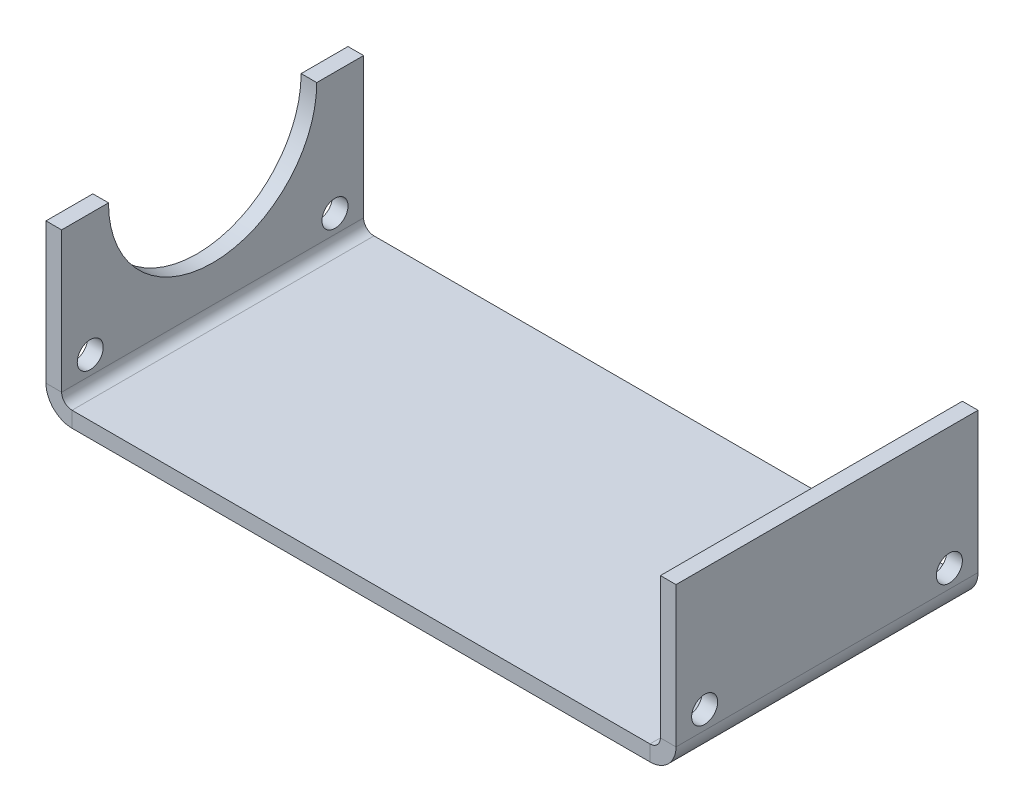
ISO-10303-21;
HEADER;
FILE_DESCRIPTION(('STEP AP214'),'2;1');
FILE_NAME('part.step','',(''),(''),'','','');
FILE_SCHEMA(('AUTOMOTIVE_DESIGN { 1 0 10303 214 1 1 1 1 }'));
ENDSEC;
DATA;
#1=APPLICATION_CONTEXT('core data for automotive mechanical design processes');
#2=APPLICATION_PROTOCOL_DEFINITION('international standard','automotive_design',2000,#1);
#3=PRODUCT_CONTEXT('',#1,'mechanical');
#4=PRODUCT('Part','Part','',(#3));
#5=PRODUCT_RELATED_PRODUCT_CATEGORY('part','',(#4));
#6=PRODUCT_DEFINITION_FORMATION('','',#4);
#7=PRODUCT_DEFINITION_CONTEXT('part definition',#1,'design');
#8=PRODUCT_DEFINITION('design','',#6,#7);
#9=PRODUCT_DEFINITION_SHAPE('','',#8);
#10=(LENGTH_UNIT() NAMED_UNIT(*) SI_UNIT(.MILLI.,.METRE.));
#11=(NAMED_UNIT(*) PLANE_ANGLE_UNIT() SI_UNIT($,.RADIAN.));
#12=(NAMED_UNIT(*) SI_UNIT($,.STERADIAN.) SOLID_ANGLE_UNIT());
#13=UNCERTAINTY_MEASURE_WITH_UNIT(LENGTH_MEASURE(1.E-05),#10,'distance_accuracy_value','');
#14=(GEOMETRIC_REPRESENTATION_CONTEXT(3) GLOBAL_UNCERTAINTY_ASSIGNED_CONTEXT((#13)) GLOBAL_UNIT_ASSIGNED_CONTEXT((#10,
#11,#12)) REPRESENTATION_CONTEXT('',''));
#15=CARTESIAN_POINT('',(0.,0.,0.));
#16=DIRECTION('',(0.,0.,1.));
#17=DIRECTION('',(1.,0.,0.));
#18=AXIS2_PLACEMENT_3D('',#15,#16,#17);
#19=CARTESIAN_POINT('',(0.,3.,0.));
#20=DIRECTION('',(0.,0.,-1.));
#21=DIRECTION('',(-1.,0.,0.));
#22=AXIS2_PLACEMENT_3D('',#19,#20,#21);
#23=PLANE('',#22);
#24=DIRECTION('',(0.,1.,0.));
#25=VECTOR('',#24,1.);
#26=CARTESIAN_POINT('',(116.,3.,0.));
#27=LINE('',#26,#25);
#28=CARTESIAN_POINT('',(116.,0.,0.));
#29=VERTEX_POINT('',#28);
#30=CARTESIAN_POINT('',(116.,3.,0.));
#31=VERTEX_POINT('',#30);
#32=EDGE_CURVE('E294',#29,#31,#27,.T.);
#33=ORIENTED_EDGE('',*,*,#32,.F.);
#34=DIRECTION('',(1.,0.,0.));
#35=VECTOR('',#34,1.);
#36=CARTESIAN_POINT('',(0.,0.,0.));
#37=LINE('',#36,#35);
#38=CARTESIAN_POINT('',(5.,0.,0.));
#39=VERTEX_POINT('',#38);
#40=EDGE_CURVE('E59',#29,#39,#37,.F.);
#41=ORIENTED_EDGE('',*,*,#40,.T.);
#42=DIRECTION('',(0.,1.,0.));
#43=VECTOR('',#42,1.);
#44=CARTESIAN_POINT('',(5.,3.,0.));
#45=LINE('',#44,#43);
#46=CARTESIAN_POINT('',(5.,3.,0.));
#47=VERTEX_POINT('',#46);
#48=EDGE_CURVE('E300',#39,#47,#45,.T.);
#49=ORIENTED_EDGE('',*,*,#48,.T.);
#50=DIRECTION('',(-1.,0.,0.));
#51=VECTOR('',#50,1.);
#52=CARTESIAN_POINT('',(0.,3.,0.));
#53=LINE('',#52,#51);
#54=EDGE_CURVE('E282',#31,#47,#53,.T.);
#55=ORIENTED_EDGE('',*,*,#54,.F.);
#56=EDGE_LOOP('',(#33,#41,#49,#55));
#57=FACE_BOUND('',#56,.T.);
#58=ADVANCED_FACE('F37',(#57),#23,.T.);
#59=CARTESIAN_POINT('',(0.,3.,58.));
#60=DIRECTION('',(0.,0.,1.));
#61=DIRECTION('',(1.,0.,0.));
#62=AXIS2_PLACEMENT_3D('',#59,#60,#61);
#63=PLANE('',#62);
#64=DIRECTION('',(0.,1.,0.));
#65=VECTOR('',#64,1.);
#66=CARTESIAN_POINT('',(5.,3.,58.));
#67=LINE('',#66,#65);
#68=CARTESIAN_POINT('',(5.,0.,58.));
#69=VERTEX_POINT('',#68);
#70=CARTESIAN_POINT('',(5.,3.,58.));
#71=VERTEX_POINT('',#70);
#72=EDGE_CURVE('E11',#69,#71,#67,.T.);
#73=ORIENTED_EDGE('',*,*,#72,.F.);
#74=DIRECTION('',(1.,0.,0.));
#75=VECTOR('',#74,1.);
#76=CARTESIAN_POINT('',(0.,0.,58.));
#77=LINE('',#76,#75);
#78=CARTESIAN_POINT('',(116.,0.,58.));
#79=VERTEX_POINT('',#78);
#80=EDGE_CURVE('E51',#69,#79,#77,.T.);
#81=ORIENTED_EDGE('',*,*,#80,.T.);
#82=DIRECTION('',(0.,1.,0.));
#83=VECTOR('',#82,1.);
#84=CARTESIAN_POINT('',(116.,3.,58.));
#85=LINE('',#84,#83);
#86=CARTESIAN_POINT('',(116.,3.,58.));
#87=VERTEX_POINT('',#86);
#88=EDGE_CURVE('E288',#79,#87,#85,.T.);
#89=ORIENTED_EDGE('',*,*,#88,.T.);
#90=DIRECTION('',(1.,0.,0.));
#91=VECTOR('',#90,1.);
#92=CARTESIAN_POINT('',(0.,3.,58.));
#93=LINE('',#92,#91);
#94=EDGE_CURVE('E280',#71,#87,#93,.T.);
#95=ORIENTED_EDGE('',*,*,#94,.F.);
#96=EDGE_LOOP('',(#73,#81,#89,#95));
#97=FACE_BOUND('',#96,.T.);
#98=ADVANCED_FACE('F362',(#97),#63,.T.);
#99=CARTESIAN_POINT('',(0.,3.,0.));
#100=DIRECTION('',(0.,1.,0.));
#101=DIRECTION('',(0.,0.,1.));
#102=AXIS2_PLACEMENT_3D('',#99,#100,#101);
#103=PLANE('',#102);
#104=ORIENTED_EDGE('',*,*,#54,.T.);
#105=DIRECTION('',(0.,0.,1.));
#106=VECTOR('',#105,1.);
#107=CARTESIAN_POINT('',(5.,3.,0.));
#108=LINE('',#107,#106);
#109=EDGE_CURVE('E297',#47,#71,#108,.T.);
#110=ORIENTED_EDGE('',*,*,#109,.T.);
#111=ORIENTED_EDGE('',*,*,#94,.T.);
#112=DIRECTION('',(0.,0.,-1.));
#113=VECTOR('',#112,1.);
#114=CARTESIAN_POINT('',(116.,3.,0.));
#115=LINE('',#114,#113);
#116=EDGE_CURVE('E285',#87,#31,#115,.T.);
#117=ORIENTED_EDGE('',*,*,#116,.T.);
#118=EDGE_LOOP('',(#104,#110,#111,#117));
#119=FACE_BOUND('',#118,.T.);
#120=ADVANCED_FACE('F314',(#119),#103,.T.);
#121=CARTESIAN_POINT('',(0.,0.,0.));
#122=DIRECTION('',(0.,1.,0.));
#123=DIRECTION('',(0.,0.,1.));
#124=AXIS2_PLACEMENT_3D('',#121,#122,#123);
#125=PLANE('',#124);
#126=ORIENTED_EDGE('',*,*,#40,.F.);
#127=DIRECTION('',(0.,0.,-1.));
#128=VECTOR('',#127,1.);
#129=CARTESIAN_POINT('',(116.,0.,0.));
#130=LINE('',#129,#128);
#131=EDGE_CURVE('E291',#79,#29,#130,.T.);
#132=ORIENTED_EDGE('',*,*,#131,.F.);
#133=ORIENTED_EDGE('',*,*,#80,.F.);
#134=DIRECTION('',(0.,0.,1.));
#135=VECTOR('',#134,1.);
#136=CARTESIAN_POINT('',(5.,0.,0.));
#137=LINE('',#136,#135);
#138=EDGE_CURVE('E44',#39,#69,#137,.T.);
#139=ORIENTED_EDGE('',*,*,#138,.F.);
#140=EDGE_LOOP('',(#126,#132,#133,#139));
#141=FACE_BOUND('',#140,.T.);
#142=ADVANCED_FACE('F307',(#141),#125,.F.);
#143=CARTESIAN_POINT('',(116.,5.,58.));
#144=DIRECTION('',(0.,0.,-1.));
#145=DIRECTION('',(-1.,0.,0.));
#146=AXIS2_PLACEMENT_3D('',#143,#144,#145);
#147=PLANE('',#146);
#148=ORIENTED_EDGE('',*,*,#88,.F.);
#149=CARTESIAN_POINT('',(116.,5.,58.));
#150=DIRECTION('',(0.,0.,-1.));
#151=DIRECTION('',(-1.,0.,0.));
#152=AXIS2_PLACEMENT_3D('',#149,#150,#151);
#153=CIRCLE('',#152,5.);
#154=CARTESIAN_POINT('',(121.,5.00000000000002,58.));
#155=VERTEX_POINT('',#154);
#156=EDGE_CURVE('E224',#79,#155,#153,.F.);
#157=ORIENTED_EDGE('',*,*,#156,.T.);
#158=DIRECTION('',(-1.,0.,0.));
#159=VECTOR('',#158,1.);
#160=CARTESIAN_POINT('',(118.,5.,58.));
#161=LINE('',#160,#159);
#162=CARTESIAN_POINT('',(118.,5.00000000000003,58.));
#163=VERTEX_POINT('',#162);
#164=EDGE_CURVE('E259',#155,#163,#161,.T.);
#165=ORIENTED_EDGE('',*,*,#164,.T.);
#166=CARTESIAN_POINT('',(116.,5.,58.));
#167=DIRECTION('',(0.,0.,1.));
#168=DIRECTION('',(1.,0.,0.));
#169=AXIS2_PLACEMENT_3D('',#166,#167,#168);
#170=CIRCLE('',#169,2.);
#171=EDGE_CURVE('E264',#87,#163,#170,.T.);
#172=ORIENTED_EDGE('',*,*,#171,.F.);
#173=EDGE_LOOP('',(#148,#157,#165,#172));
#174=FACE_BOUND('',#173,.T.);
#175=ADVANCED_FACE('F335',(#174),#147,.F.);
#176=CARTESIAN_POINT('',(116.,5.,0.));
#177=DIRECTION('',(0.,0.,1.));
#178=DIRECTION('',(1.,0.,0.));
#179=AXIS2_PLACEMENT_3D('',#176,#177,#178);
#180=PLANE('',#179);
#181=DIRECTION('',(-1.,0.,0.));
#182=VECTOR('',#181,1.);
#183=CARTESIAN_POINT('',(118.,5.,0.));
#184=LINE('',#183,#182);
#185=CARTESIAN_POINT('',(121.,5.,0.));
#186=VERTEX_POINT('',#185);
#187=CARTESIAN_POINT('',(118.,5.,0.));
#188=VERTEX_POINT('',#187);
#189=EDGE_CURVE('E222',#186,#188,#184,.T.);
#190=ORIENTED_EDGE('',*,*,#189,.F.);
#191=CARTESIAN_POINT('',(116.,5.,0.));
#192=DIRECTION('',(0.,0.,-1.));
#193=DIRECTION('',(-1.,0.,0.));
#194=AXIS2_PLACEMENT_3D('',#191,#192,#193);
#195=CIRCLE('',#194,5.);
#196=EDGE_CURVE('E268',#186,#29,#195,.T.);
#197=ORIENTED_EDGE('',*,*,#196,.T.);
#198=ORIENTED_EDGE('',*,*,#32,.T.);
#199=CARTESIAN_POINT('',(116.,5.,0.));
#200=DIRECTION('',(0.,0.,-1.));
#201=DIRECTION('',(-1.,0.,0.));
#202=AXIS2_PLACEMENT_3D('',#199,#200,#201);
#203=CIRCLE('',#202,2.);
#204=EDGE_CURVE('E267',#188,#31,#203,.T.);
#205=ORIENTED_EDGE('',*,*,#204,.F.);
#206=EDGE_LOOP('',(#190,#197,#198,#205));
#207=FACE_BOUND('',#206,.T.);
#208=ADVANCED_FACE('F319',(#207),#180,.F.);
#209=CARTESIAN_POINT('',(116.,5.,87.3371722273058));
#210=DIRECTION('',(0.,0.,-1.));
#211=DIRECTION('',(-1.,0.,0.));
#212=AXIS2_PLACEMENT_3D('',#209,#210,#211);
#213=CYLINDRICAL_SURFACE('',#212,2.);
#214=ORIENTED_EDGE('',*,*,#204,.T.);
#215=ORIENTED_EDGE('',*,*,#116,.F.);
#216=ORIENTED_EDGE('',*,*,#171,.T.);
#217=DIRECTION('',(0.,0.,1.));
#218=VECTOR('',#217,1.);
#219=CARTESIAN_POINT('',(118.,4.99999999999999,0.));
#220=LINE('',#219,#218);
#221=EDGE_CURVE('E237',#188,#163,#220,.T.);
#222=ORIENTED_EDGE('',*,*,#221,.F.);
#223=EDGE_LOOP('',(#214,#215,#216,#222));
#224=FACE_BOUND('',#223,.T.);
#225=ADVANCED_FACE('F322',(#224),#213,.F.);
#226=CARTESIAN_POINT('',(116.,5.,87.3371722273058));
#227=DIRECTION('',(0.,0.,-1.));
#228=DIRECTION('',(-1.,0.,0.));
#229=AXIS2_PLACEMENT_3D('',#226,#227,#228);
#230=CYLINDRICAL_SURFACE('',#229,5.);
#231=ORIENTED_EDGE('',*,*,#196,.F.);
#232=DIRECTION('',(0.,0.,1.));
#233=VECTOR('',#232,1.);
#234=CARTESIAN_POINT('',(121.,5.,0.));
#235=LINE('',#234,#233);
#236=EDGE_CURVE('E216',#186,#155,#235,.T.);
#237=ORIENTED_EDGE('',*,*,#236,.T.);
#238=ORIENTED_EDGE('',*,*,#156,.F.);
#239=ORIENTED_EDGE('',*,*,#131,.T.);
#240=EDGE_LOOP('',(#231,#237,#238,#239));
#241=FACE_BOUND('',#240,.T.);
#242=ADVANCED_FACE('F338',(#241),#230,.T.);
#243=CARTESIAN_POINT('',(118.,32.,0.));
#244=DIRECTION('',(0.,1.,0.));
#245=DIRECTION('',(0.,0.,1.));
#246=AXIS2_PLACEMENT_3D('',#243,#244,#245);
#247=PLANE('',#246);
#248=DIRECTION('',(-1.,0.,0.));
#249=VECTOR('',#248,1.);
#250=CARTESIAN_POINT('',(118.,32.,58.));
#251=LINE('',#250,#249);
#252=CARTESIAN_POINT('',(121.,32.,58.));
#253=VERTEX_POINT('',#252);
#254=CARTESIAN_POINT('',(118.,32.,58.));
#255=VERTEX_POINT('',#254);
#256=EDGE_CURVE('E235',#253,#255,#251,.T.);
#257=ORIENTED_EDGE('',*,*,#256,.F.);
#258=DIRECTION('',(0.,0.,-1.));
#259=VECTOR('',#258,1.);
#260=CARTESIAN_POINT('',(121.,32.,0.));
#261=LINE('',#260,#259);
#262=CARTESIAN_POINT('',(121.,32.,0.));
#263=VERTEX_POINT('',#262);
#264=EDGE_CURVE('E229',#263,#253,#261,.F.);
#265=ORIENTED_EDGE('',*,*,#264,.F.);
#266=DIRECTION('',(-1.,0.,0.));
#267=VECTOR('',#266,1.);
#268=CARTESIAN_POINT('',(118.,32.,0.));
#269=LINE('',#268,#267);
#270=CARTESIAN_POINT('',(118.,32.,0.));
#271=VERTEX_POINT('',#270);
#272=EDGE_CURVE('E257',#263,#271,#269,.T.);
#273=ORIENTED_EDGE('',*,*,#272,.T.);
#274=DIRECTION('',(0.,0.,1.));
#275=VECTOR('',#274,1.);
#276=CARTESIAN_POINT('',(118.,32.,0.));
#277=LINE('',#276,#275);
#278=EDGE_CURVE('E254',#271,#255,#277,.T.);
#279=ORIENTED_EDGE('',*,*,#278,.T.);
#280=EDGE_LOOP('',(#257,#265,#273,#279));
#281=FACE_BOUND('',#280,.T.);
#282=ADVANCED_FACE('F347',(#281),#247,.T.);
#283=CARTESIAN_POINT('',(118.,8.49999999999999,52.5));
#284=DIRECTION('',(1.,0.,0.));
#285=DIRECTION('',(0.,0.,-1.));
#286=AXIS2_PLACEMENT_3D('',#283,#284,#285);
#287=CYLINDRICAL_SURFACE('',#286,2.5);
#288=CARTESIAN_POINT('',(118.,8.49999999999999,52.5));
#289=DIRECTION('',(1.,0.,0.));
#290=DIRECTION('',(0.,0.,-1.));
#291=AXIS2_PLACEMENT_3D('',#288,#289,#290);
#292=CIRCLE('',#291,2.5);
#293=CARTESIAN_POINT('',(118.,8.49999999999999,50.));
#294=VERTEX_POINT('',#293);
#295=EDGE_CURVE('E242',#294,#294,#292,.T.);
#296=ORIENTED_EDGE('',*,*,#295,.F.);
#297=EDGE_LOOP('',(#296));
#298=FACE_BOUND('',#297,.T.);
#299=CARTESIAN_POINT('',(121.,8.49999999999999,52.5));
#300=DIRECTION('',(1.,0.,0.));
#301=DIRECTION('',(0.,0.,-1.));
#302=AXIS2_PLACEMENT_3D('',#299,#300,#301);
#303=CIRCLE('',#302,2.5);
#304=CARTESIAN_POINT('',(121.,8.49999999999999,50.));
#305=VERTEX_POINT('',#304);
#306=EDGE_CURVE('E251',#305,#305,#303,.T.);
#307=ORIENTED_EDGE('',*,*,#306,.T.);
#308=EDGE_LOOP('',(#307));
#309=FACE_BOUND('',#308,.T.);
#310=ADVANCED_FACE('F349',(#298,#309),#287,.F.);
#311=CARTESIAN_POINT('',(118.,8.50000000000001,5.50000000000002));
#312=DIRECTION('',(1.,0.,0.));
#313=DIRECTION('',(0.,0.,-1.));
#314=AXIS2_PLACEMENT_3D('',#311,#312,#313);
#315=CYLINDRICAL_SURFACE('',#314,2.5);
#316=CARTESIAN_POINT('',(118.,8.50000000000001,5.50000000000002));
#317=DIRECTION('',(1.,0.,0.));
#318=DIRECTION('',(0.,0.,-1.));
#319=AXIS2_PLACEMENT_3D('',#316,#317,#318);
#320=CIRCLE('',#319,2.5);
#321=CARTESIAN_POINT('',(118.,8.50000000000001,3.00000000000002));
#322=VERTEX_POINT('',#321);
#323=EDGE_CURVE('E245',#322,#322,#320,.T.);
#324=ORIENTED_EDGE('',*,*,#323,.F.);
#325=EDGE_LOOP('',(#324));
#326=FACE_BOUND('',#325,.T.);
#327=CARTESIAN_POINT('',(121.,8.50000000000001,5.50000000000002));
#328=DIRECTION('',(1.,0.,0.));
#329=DIRECTION('',(0.,0.,-1.));
#330=AXIS2_PLACEMENT_3D('',#327,#328,#329);
#331=CIRCLE('',#330,2.5);
#332=CARTESIAN_POINT('',(121.,8.50000000000001,3.00000000000002));
#333=VERTEX_POINT('',#332);
#334=EDGE_CURVE('E248',#333,#333,#331,.T.);
#335=ORIENTED_EDGE('',*,*,#334,.T.);
#336=EDGE_LOOP('',(#335));
#337=FACE_BOUND('',#336,.T.);
#338=ADVANCED_FACE('F355',(#326,#337),#315,.F.);
#339=CARTESIAN_POINT('',(118.,32.,0.));
#340=DIRECTION('',(1.,0.,0.));
#341=DIRECTION('',(0.,0.,-1.));
#342=AXIS2_PLACEMENT_3D('',#339,#340,#341);
#343=PLANE('',#342);
#344=ORIENTED_EDGE('',*,*,#323,.T.);
#345=EDGE_LOOP('',(#344));
#346=FACE_BOUND('',#345,.T.);
#347=ORIENTED_EDGE('',*,*,#295,.T.);
#348=EDGE_LOOP('',(#347));
#349=FACE_BOUND('',#348,.T.);
#350=DIRECTION('',(0.,-1.,0.));
#351=VECTOR('',#350,1.);
#352=CARTESIAN_POINT('',(118.,32.,0.));
#353=LINE('',#352,#351);
#354=EDGE_CURVE('E239',#271,#188,#353,.T.);
#355=ORIENTED_EDGE('',*,*,#354,.T.);
#356=ORIENTED_EDGE('',*,*,#221,.T.);
#357=DIRECTION('',(0.,-1.,0.));
#358=VECTOR('',#357,1.);
#359=CARTESIAN_POINT('',(118.,32.,58.));
#360=LINE('',#359,#358);
#361=EDGE_CURVE('E232',#255,#163,#360,.T.);
#362=ORIENTED_EDGE('',*,*,#361,.F.);
#363=ORIENTED_EDGE('',*,*,#278,.F.);
#364=EDGE_LOOP('',(#355,#356,#362,#363));
#365=FACE_BOUND('',#364,.T.);
#366=ADVANCED_FACE('F326',(#346,#349,#365),#343,.F.);
#367=CARTESIAN_POINT('',(118.,32.,58.));
#368=DIRECTION('',(0.,0.,1.));
#369=DIRECTION('',(0.,-1.,0.));
#370=AXIS2_PLACEMENT_3D('',#367,#368,#369);
#371=PLANE('',#370);
#372=ORIENTED_EDGE('',*,*,#164,.F.);
#373=DIRECTION('',(0.,1.,0.));
#374=VECTOR('',#373,1.);
#375=CARTESIAN_POINT('',(121.,32.,58.));
#376=LINE('',#375,#374);
#377=EDGE_CURVE('E227',#253,#155,#376,.F.);
#378=ORIENTED_EDGE('',*,*,#377,.F.);
#379=ORIENTED_EDGE('',*,*,#256,.T.);
#380=ORIENTED_EDGE('',*,*,#361,.T.);
#381=EDGE_LOOP('',(#372,#378,#379,#380));
#382=FACE_BOUND('',#381,.T.);
#383=ADVANCED_FACE('F331',(#382),#371,.T.);
#384=CARTESIAN_POINT('',(121.,32.,0.));
#385=DIRECTION('',(1.,0.,0.));
#386=DIRECTION('',(0.,0.,-1.));
#387=AXIS2_PLACEMENT_3D('',#384,#385,#386);
#388=PLANE('',#387);
#389=ORIENTED_EDGE('',*,*,#334,.F.);
#390=EDGE_LOOP('',(#389));
#391=FACE_BOUND('',#390,.T.);
#392=ORIENTED_EDGE('',*,*,#306,.F.);
#393=EDGE_LOOP('',(#392));
#394=FACE_BOUND('',#393,.T.);
#395=DIRECTION('',(0.,1.,0.));
#396=VECTOR('',#395,1.);
#397=CARTESIAN_POINT('',(121.,32.,0.));
#398=LINE('',#397,#396);
#399=EDGE_CURVE('E225',#263,#186,#398,.F.);
#400=ORIENTED_EDGE('',*,*,#399,.F.);
#401=ORIENTED_EDGE('',*,*,#264,.T.);
#402=ORIENTED_EDGE('',*,*,#377,.T.);
#403=ORIENTED_EDGE('',*,*,#236,.F.);
#404=EDGE_LOOP('',(#400,#401,#402,#403));
#405=FACE_BOUND('',#404,.T.);
#406=ADVANCED_FACE('F342',(#391,#394,#405),#388,.T.);
#407=CARTESIAN_POINT('',(118.,32.,0.));
#408=DIRECTION('',(0.,0.,1.));
#409=DIRECTION('',(0.,-1.,0.));
#410=AXIS2_PLACEMENT_3D('',#407,#408,#409);
#411=PLANE('',#410);
#412=ORIENTED_EDGE('',*,*,#272,.F.);
#413=ORIENTED_EDGE('',*,*,#399,.T.);
#414=ORIENTED_EDGE('',*,*,#189,.T.);
#415=ORIENTED_EDGE('',*,*,#354,.F.);
#416=EDGE_LOOP('',(#412,#413,#414,#415));
#417=FACE_BOUND('',#416,.T.);
#418=ADVANCED_FACE('F344',(#417),#411,.F.);
#419=CARTESIAN_POINT('',(5.,5.,0.));
#420=DIRECTION('',(0.,0.,1.));
#421=DIRECTION('',(0.,-1.,0.));
#422=AXIS2_PLACEMENT_3D('',#419,#420,#421);
#423=PLANE('',#422);
#424=ORIENTED_EDGE('',*,*,#48,.F.);
#425=CARTESIAN_POINT('',(5.,5.,0.));
#426=DIRECTION('',(0.,0.,1.));
#427=DIRECTION('',(1.,0.,0.));
#428=AXIS2_PLACEMENT_3D('',#425,#426,#427);
#429=CIRCLE('',#428,5.);
#430=CARTESIAN_POINT('',(0.,5.00000000000001,0.));
#431=VERTEX_POINT('',#430);
#432=EDGE_CURVE('E219',#39,#431,#429,.F.);
#433=ORIENTED_EDGE('',*,*,#432,.T.);
#434=DIRECTION('',(1.,0.,0.));
#435=VECTOR('',#434,1.);
#436=CARTESIAN_POINT('',(3.,5.,0.));
#437=LINE('',#436,#435);
#438=CARTESIAN_POINT('',(3.,5.00000000000003,0.));
#439=VERTEX_POINT('',#438);
#440=EDGE_CURVE('E149',#431,#439,#437,.T.);
#441=ORIENTED_EDGE('',*,*,#440,.T.);
#442=CARTESIAN_POINT('',(5.,5.,0.));
#443=DIRECTION('',(0.,0.,-1.));
#444=DIRECTION('',(0.,1.,0.));
#445=AXIS2_PLACEMENT_3D('',#442,#443,#444);
#446=CIRCLE('',#445,2.);
#447=EDGE_CURVE('E209',#47,#439,#446,.T.);
#448=ORIENTED_EDGE('',*,*,#447,.F.);
#449=EDGE_LOOP('',(#424,#433,#441,#448));
#450=FACE_BOUND('',#449,.T.);
#451=ADVANCED_FACE('F310',(#450),#423,.F.);
#452=CARTESIAN_POINT('',(5.,5.,58.));
#453=DIRECTION('',(0.,0.,-1.));
#454=DIRECTION('',(-1.,0.,0.));
#455=AXIS2_PLACEMENT_3D('',#452,#453,#454);
#456=PLANE('',#455);
#457=DIRECTION('',(1.,0.,0.));
#458=VECTOR('',#457,1.);
#459=CARTESIAN_POINT('',(3.,5.,58.));
#460=LINE('',#459,#458);
#461=CARTESIAN_POINT('',(0.,5.,58.));
#462=VERTEX_POINT('',#461);
#463=CARTESIAN_POINT('',(3.,5.,58.));
#464=VERTEX_POINT('',#463);
#465=EDGE_CURVE('E160',#462,#464,#460,.T.);
#466=ORIENTED_EDGE('',*,*,#465,.F.);
#467=CARTESIAN_POINT('',(5.,5.,57.9999999999999));
#468=DIRECTION('',(0.,0.,1.));
#469=DIRECTION('',(1.,0.,0.));
#470=AXIS2_PLACEMENT_3D('',#467,#468,#469);
#471=CIRCLE('',#470,5.);
#472=EDGE_CURVE('E213',#462,#69,#471,.T.);
#473=ORIENTED_EDGE('',*,*,#472,.T.);
#474=ORIENTED_EDGE('',*,*,#72,.T.);
#475=CARTESIAN_POINT('',(5.,5.,58.));
#476=DIRECTION('',(0.,0.,1.));
#477=DIRECTION('',(1.,0.,0.));
#478=AXIS2_PLACEMENT_3D('',#475,#476,#477);
#479=CIRCLE('',#478,2.);
#480=EDGE_CURVE('E212',#464,#71,#479,.T.);
#481=ORIENTED_EDGE('',*,*,#480,.F.);
#482=EDGE_LOOP('',(#466,#473,#474,#481));
#483=FACE_BOUND('',#482,.T.);
#484=ADVANCED_FACE('F428',(#483),#456,.F.);
#485=CARTESIAN_POINT('',(5.,5.,-29.3371722273058));
#486=DIRECTION('',(0.,0.,1.));
#487=DIRECTION('',(1.,0.,0.));
#488=AXIS2_PLACEMENT_3D('',#485,#486,#487);
#489=CYLINDRICAL_SURFACE('',#488,2.);
#490=ORIENTED_EDGE('',*,*,#480,.T.);
#491=ORIENTED_EDGE('',*,*,#109,.F.);
#492=ORIENTED_EDGE('',*,*,#447,.T.);
#493=DIRECTION('',(0.,0.,-1.));
#494=VECTOR('',#493,1.);
#495=CARTESIAN_POINT('',(3.,4.99999999999999,0.));
#496=LINE('',#495,#494);
#497=EDGE_CURVE('E181',#464,#439,#496,.T.);
#498=ORIENTED_EDGE('',*,*,#497,.F.);
#499=EDGE_LOOP('',(#490,#491,#492,#498));
#500=FACE_BOUND('',#499,.T.);
#501=ADVANCED_FACE('F437',(#500),#489,.F.);
#502=CARTESIAN_POINT('',(5.,5.,-29.3371722273058));
#503=DIRECTION('',(0.,0.,1.));
#504=DIRECTION('',(1.,0.,0.));
#505=AXIS2_PLACEMENT_3D('',#502,#503,#504);
#506=CYLINDRICAL_SURFACE('',#505,5.);
#507=ORIENTED_EDGE('',*,*,#472,.F.);
#508=DIRECTION('',(0.,0.,-1.));
#509=VECTOR('',#508,1.);
#510=CARTESIAN_POINT('',(0.,5.,0.));
#511=LINE('',#510,#509);
#512=EDGE_CURVE('E158',#462,#431,#511,.T.);
#513=ORIENTED_EDGE('',*,*,#512,.T.);
#514=ORIENTED_EDGE('',*,*,#432,.F.);
#515=ORIENTED_EDGE('',*,*,#138,.T.);
#516=EDGE_LOOP('',(#507,#513,#514,#515));
#517=FACE_BOUND('',#516,.T.);
#518=ADVANCED_FACE('F305',(#517),#506,.T.);
#519=CARTESIAN_POINT('',(3.,32.,0.));
#520=DIRECTION('',(0.,1.,0.));
#521=DIRECTION('',(0.,0.,-1.));
#522=AXIS2_PLACEMENT_3D('',#519,#520,#521);
#523=PLANE('',#522);
#524=DIRECTION('',(1.,0.,0.));
#525=VECTOR('',#524,1.);
#526=CARTESIAN_POINT('',(3.00000000000001,32.,49.));
#527=LINE('',#526,#525);
#528=CARTESIAN_POINT('',(0.,32.,49.));
#529=VERTEX_POINT('',#528);
#530=CARTESIAN_POINT('',(3.00000000000001,32.,49.));
#531=VERTEX_POINT('',#530);
#532=EDGE_CURVE('E164',#529,#531,#527,.T.);
#533=ORIENTED_EDGE('',*,*,#532,.F.);
#534=DIRECTION('',(0.,0.,1.));
#535=VECTOR('',#534,1.);
#536=CARTESIAN_POINT('',(0.,32.,0.));
#537=LINE('',#536,#535);
#538=CARTESIAN_POINT('',(0.,32.,58.));
#539=VERTEX_POINT('',#538);
#540=EDGE_CURVE('E155',#539,#529,#537,.F.);
#541=ORIENTED_EDGE('',*,*,#540,.F.);
#542=DIRECTION('',(1.,0.,0.));
#543=VECTOR('',#542,1.);
#544=CARTESIAN_POINT('',(3.,32.,58.));
#545=LINE('',#544,#543);
#546=CARTESIAN_POINT('',(3.,32.,58.));
#547=VERTEX_POINT('',#546);
#548=EDGE_CURVE('E137',#539,#547,#545,.T.);
#549=ORIENTED_EDGE('',*,*,#548,.T.);
#550=DIRECTION('',(0.,0.,-1.));
#551=VECTOR('',#550,1.);
#552=CARTESIAN_POINT('',(3.,32.,0.));
#553=LINE('',#552,#551);
#554=EDGE_CURVE('E148',#547,#531,#553,.T.);
#555=ORIENTED_EDGE('',*,*,#554,.T.);
#556=EDGE_LOOP('',(#533,#541,#549,#555));
#557=FACE_BOUND('',#556,.T.);
#558=ADVANCED_FACE('F163',(#557),#523,.T.);
#559=CARTESIAN_POINT('',(3.,32.,29.));
#560=DIRECTION('',(-1.,0.,0.));
#561=DIRECTION('',(0.,0.,1.));
#562=AXIS2_PLACEMENT_3D('',#559,#560,#561);
#563=CYLINDRICAL_SURFACE('',#562,20.);
#564=DIRECTION('',(1.,0.,0.));
#565=VECTOR('',#564,1.);
#566=CARTESIAN_POINT('',(3.00000000000001,32.,9.));
#567=LINE('',#566,#565);
#568=CARTESIAN_POINT('',(0.,32.,9.));
#569=VERTEX_POINT('',#568);
#570=CARTESIAN_POINT('',(3.00000000000001,32.,9.));
#571=VERTEX_POINT('',#570);
#572=EDGE_CURVE('E201',#569,#571,#567,.T.);
#573=ORIENTED_EDGE('',*,*,#572,.F.);
#574=CARTESIAN_POINT('',(0.,32.,29.));
#575=DIRECTION('',(-1.,0.,0.));
#576=DIRECTION('',(0.,0.,1.));
#577=AXIS2_PLACEMENT_3D('',#574,#575,#576);
#578=CIRCLE('',#577,20.);
#579=EDGE_CURVE('E204',#569,#529,#578,.T.);
#580=ORIENTED_EDGE('',*,*,#579,.T.);
#581=ORIENTED_EDGE('',*,*,#532,.T.);
#582=CARTESIAN_POINT('',(3.,32.,29.));
#583=DIRECTION('',(-1.,0.,0.));
#584=DIRECTION('',(0.,0.,1.));
#585=AXIS2_PLACEMENT_3D('',#582,#583,#584);
#586=CIRCLE('',#585,20.);
#587=EDGE_CURVE('E178',#571,#531,#586,.T.);
#588=ORIENTED_EDGE('',*,*,#587,.F.);
#589=EDGE_LOOP('',(#573,#580,#581,#588));
#590=FACE_BOUND('',#589,.T.);
#591=ADVANCED_FACE('F463',(#590),#563,.F.);
#592=DIRECTION('',(1.,0.,0.));
#593=VECTOR('',#592,1.);
#594=CARTESIAN_POINT('',(3.,32.,0.));
#595=LINE('',#594,#593);
#596=CARTESIAN_POINT('',(0.,32.,0.));
#597=VERTEX_POINT('',#596);
#598=CARTESIAN_POINT('',(3.,32.,0.));
#599=VERTEX_POINT('',#598);
#600=EDGE_CURVE('E171',#597,#599,#595,.T.);
#601=ORIENTED_EDGE('',*,*,#600,.F.);
#602=DIRECTION('',(0.,0.,1.));
#603=VECTOR('',#602,1.);
#604=CARTESIAN_POINT('',(0.,32.,0.));
#605=LINE('',#604,#603);
#606=EDGE_CURVE('E165',#569,#597,#605,.F.);
#607=ORIENTED_EDGE('',*,*,#606,.F.);
#608=ORIENTED_EDGE('',*,*,#572,.T.);
#609=EDGE_CURVE('E198',#571,#599,#553,.T.);
#610=ORIENTED_EDGE('',*,*,#609,.T.);
#611=EDGE_LOOP('',(#601,#607,#608,#610));
#612=FACE_BOUND('',#611,.T.);
#613=ADVANCED_FACE('F465',(#612),#523,.T.);
#614=CARTESIAN_POINT('',(3.,8.49999999999999,5.5));
#615=DIRECTION('',(-1.,0.,0.));
#616=DIRECTION('',(0.,0.,1.));
#617=AXIS2_PLACEMENT_3D('',#614,#615,#616);
#618=CYLINDRICAL_SURFACE('',#617,2.5);
#619=CARTESIAN_POINT('',(3.,8.49999999999999,5.5));
#620=DIRECTION('',(-1.,0.,0.));
#621=DIRECTION('',(0.,0.,1.));
#622=AXIS2_PLACEMENT_3D('',#619,#620,#621);
#623=CIRCLE('',#622,2.5);
#624=CARTESIAN_POINT('',(3.,8.49999999999999,8.));
#625=VERTEX_POINT('',#624);
#626=EDGE_CURVE('E184',#625,#625,#623,.T.);
#627=ORIENTED_EDGE('',*,*,#626,.F.);
#628=EDGE_LOOP('',(#627));
#629=FACE_BOUND('',#628,.T.);
#630=CARTESIAN_POINT('',(0.,8.49999999999999,5.5));
#631=DIRECTION('',(-1.,0.,0.));
#632=DIRECTION('',(0.,0.,1.));
#633=AXIS2_PLACEMENT_3D('',#630,#631,#632);
#634=CIRCLE('',#633,2.5);
#635=CARTESIAN_POINT('',(0.,8.49999999999999,8.));
#636=VERTEX_POINT('',#635);
#637=EDGE_CURVE('E195',#636,#636,#634,.T.);
#638=ORIENTED_EDGE('',*,*,#637,.T.);
#639=EDGE_LOOP('',(#638));
#640=FACE_BOUND('',#639,.T.);
#641=ADVANCED_FACE('F478',(#629,#640),#618,.F.);
#642=CARTESIAN_POINT('',(3.,8.49999999999999,52.5));
#643=DIRECTION('',(-1.,0.,0.));
#644=DIRECTION('',(0.,0.,1.));
#645=AXIS2_PLACEMENT_3D('',#642,#643,#644);
#646=CYLINDRICAL_SURFACE('',#645,2.5);
#647=CARTESIAN_POINT('',(3.,8.49999999999999,52.5));
#648=DIRECTION('',(-1.,0.,0.));
#649=DIRECTION('',(0.,0.,1.));
#650=AXIS2_PLACEMENT_3D('',#647,#648,#649);
#651=CIRCLE('',#650,2.5);
#652=CARTESIAN_POINT('',(3.,8.49999999999999,55.));
#653=VERTEX_POINT('',#652);
#654=EDGE_CURVE('E189',#653,#653,#651,.T.);
#655=ORIENTED_EDGE('',*,*,#654,.F.);
#656=EDGE_LOOP('',(#655));
#657=FACE_BOUND('',#656,.T.);
#658=CARTESIAN_POINT('',(0.,8.49999999999999,52.5));
#659=DIRECTION('',(-1.,0.,0.));
#660=DIRECTION('',(0.,0.,1.));
#661=AXIS2_PLACEMENT_3D('',#658,#659,#660);
#662=CIRCLE('',#661,2.5);
#663=CARTESIAN_POINT('',(0.,8.49999999999999,55.));
#664=VERTEX_POINT('',#663);
#665=EDGE_CURVE('E192',#664,#664,#662,.T.);
#666=ORIENTED_EDGE('',*,*,#665,.T.);
#667=EDGE_LOOP('',(#666));
#668=FACE_BOUND('',#667,.T.);
#669=ADVANCED_FACE('F485',(#657,#668),#646,.F.);
#670=CARTESIAN_POINT('',(3.,32.,0.));
#671=DIRECTION('',(-1.,0.,0.));
#672=DIRECTION('',(0.,0.,1.));
#673=AXIS2_PLACEMENT_3D('',#670,#671,#672);
#674=PLANE('',#673);
#675=ORIENTED_EDGE('',*,*,#654,.T.);
#676=EDGE_LOOP('',(#675));
#677=FACE_BOUND('',#676,.T.);
#678=ORIENTED_EDGE('',*,*,#626,.T.);
#679=EDGE_LOOP('',(#678));
#680=FACE_BOUND('',#679,.T.);
#681=DIRECTION('',(0.,-1.,0.));
#682=VECTOR('',#681,1.);
#683=CARTESIAN_POINT('',(3.,32.,58.));
#684=LINE('',#683,#682);
#685=EDGE_CURVE('E143',#547,#464,#684,.T.);
#686=ORIENTED_EDGE('',*,*,#685,.T.);
#687=ORIENTED_EDGE('',*,*,#497,.T.);
#688=DIRECTION('',(0.,-1.,0.));
#689=VECTOR('',#688,1.);
#690=CARTESIAN_POINT('',(3.,32.,0.));
#691=LINE('',#690,#689);
#692=EDGE_CURVE('E166',#599,#439,#691,.T.);
#693=ORIENTED_EDGE('',*,*,#692,.F.);
#694=ORIENTED_EDGE('',*,*,#609,.F.);
#695=ORIENTED_EDGE('',*,*,#587,.T.);
#696=ORIENTED_EDGE('',*,*,#554,.F.);
#697=EDGE_LOOP('',(#686,#687,#693,#694,#695,#696));
#698=FACE_BOUND('',#697,.T.);
#699=ADVANCED_FACE('F493',(#677,#680,#698),#674,.F.);
#700=CARTESIAN_POINT('',(3.,32.,0.));
#701=DIRECTION('',(0.,0.,-1.));
#702=DIRECTION('',(0.,-1.,0.));
#703=AXIS2_PLACEMENT_3D('',#700,#701,#702);
#704=PLANE('',#703);
#705=ORIENTED_EDGE('',*,*,#440,.F.);
#706=DIRECTION('',(0.,1.,0.));
#707=VECTOR('',#706,1.);
#708=CARTESIAN_POINT('',(0.,32.,0.));
#709=LINE('',#708,#707);
#710=EDGE_CURVE('E161',#597,#431,#709,.F.);
#711=ORIENTED_EDGE('',*,*,#710,.F.);
#712=ORIENTED_EDGE('',*,*,#600,.T.);
#713=ORIENTED_EDGE('',*,*,#692,.T.);
#714=EDGE_LOOP('',(#705,#711,#712,#713));
#715=FACE_BOUND('',#714,.T.);
#716=ADVANCED_FACE('F501',(#715),#704,.T.);
#717=CARTESIAN_POINT('',(0.,32.,0.));
#718=DIRECTION('',(-1.,0.,0.));
#719=DIRECTION('',(0.,0.,1.));
#720=AXIS2_PLACEMENT_3D('',#717,#718,#719);
#721=PLANE('',#720);
#722=ORIENTED_EDGE('',*,*,#665,.F.);
#723=EDGE_LOOP('',(#722));
#724=FACE_BOUND('',#723,.T.);
#725=ORIENTED_EDGE('',*,*,#637,.F.);
#726=EDGE_LOOP('',(#725));
#727=FACE_BOUND('',#726,.T.);
#728=DIRECTION('',(0.,1.,0.));
#729=VECTOR('',#728,1.);
#730=CARTESIAN_POINT('',(0.,32.,58.));
#731=LINE('',#730,#729);
#732=EDGE_CURVE('E140',#539,#462,#731,.F.);
#733=ORIENTED_EDGE('',*,*,#732,.F.);
#734=ORIENTED_EDGE('',*,*,#540,.T.);
#735=ORIENTED_EDGE('',*,*,#579,.F.);
#736=ORIENTED_EDGE('',*,*,#606,.T.);
#737=ORIENTED_EDGE('',*,*,#710,.T.);
#738=ORIENTED_EDGE('',*,*,#512,.F.);
#739=EDGE_LOOP('',(#733,#734,#735,#736,#737,#738));
#740=FACE_BOUND('',#739,.T.);
#741=ADVANCED_FACE('F153',(#724,#727,#740),#721,.T.);
#742=CARTESIAN_POINT('',(3.,32.,58.));
#743=DIRECTION('',(0.,0.,-1.));
#744=DIRECTION('',(0.,-1.,0.));
#745=AXIS2_PLACEMENT_3D('',#742,#743,#744);
#746=PLANE('',#745);
#747=ORIENTED_EDGE('',*,*,#548,.F.);
#748=ORIENTED_EDGE('',*,*,#732,.T.);
#749=ORIENTED_EDGE('',*,*,#465,.T.);
#750=ORIENTED_EDGE('',*,*,#685,.F.);
#751=EDGE_LOOP('',(#747,#748,#749,#750));
#752=FACE_BOUND('',#751,.T.);
#753=ADVANCED_FACE('F139',(#752),#746,.F.);
#754=CLOSED_SHELL('',(#58,#98,#120,#142,#175,#208,#225,#242,#282,#310,#338,#366,#383,#406,#418,
#451,#484,#501,#518,#558,#591,#613,#641,#669,#699,#716,#741,#753));
#755=MANIFOLD_SOLID_BREP('B2',#754);
#756=ADVANCED_BREP_SHAPE_REPRESENTATION('',(#18,#755),#14);
#757=SHAPE_DEFINITION_REPRESENTATION(#9,#756);
ENDSEC;
END-ISO-10303-21;
